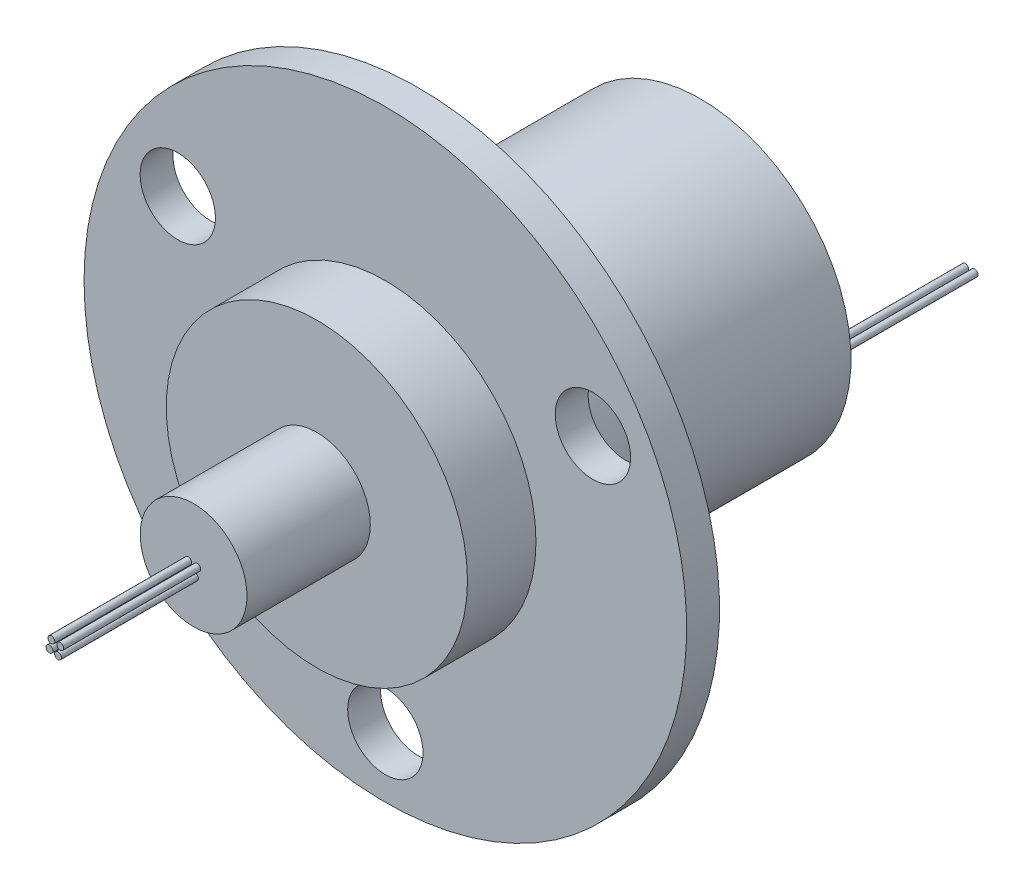
ISO-10303-21;
HEADER;
FILE_DESCRIPTION(('STEP AP214'),'2;1');
FILE_NAME('part.step','',(''),(''),'','','');
FILE_SCHEMA(('AUTOMOTIVE_DESIGN { 1 0 10303 214 1 1 1 1 }'));
ENDSEC;
DATA;
#1=APPLICATION_CONTEXT('core data for automotive mechanical design processes');
#2=APPLICATION_PROTOCOL_DEFINITION('international standard','automotive_design',2000,#1);
#3=PRODUCT_CONTEXT('',#1,'mechanical');
#4=PRODUCT('Part','Part','',(#3));
#5=PRODUCT_RELATED_PRODUCT_CATEGORY('part','',(#4));
#6=PRODUCT_DEFINITION_FORMATION('','',#4);
#7=PRODUCT_DEFINITION_CONTEXT('part definition',#1,'design');
#8=PRODUCT_DEFINITION('design','',#6,#7);
#9=PRODUCT_DEFINITION_SHAPE('','',#8);
#10=(LENGTH_UNIT() NAMED_UNIT(*) SI_UNIT(.MILLI.,.METRE.));
#11=(NAMED_UNIT(*) PLANE_ANGLE_UNIT() SI_UNIT($,.RADIAN.));
#12=(NAMED_UNIT(*) SI_UNIT($,.STERADIAN.) SOLID_ANGLE_UNIT());
#13=UNCERTAINTY_MEASURE_WITH_UNIT(LENGTH_MEASURE(1.E-05),#10,'distance_accuracy_value','');
#14=(GEOMETRIC_REPRESENTATION_CONTEXT(3) GLOBAL_UNCERTAINTY_ASSIGNED_CONTEXT((#13)) GLOBAL_UNIT_ASSIGNED_CONTEXT((#10,
#11,#12)) REPRESENTATION_CONTEXT('',''));
#15=CARTESIAN_POINT('',(0.,0.,0.));
#16=DIRECTION('',(0.,0.,1.));
#17=DIRECTION('',(1.,0.,0.));
#18=AXIS2_PLACEMENT_3D('',#15,#16,#17);
#19=CARTESIAN_POINT('',(0.,0.,0.));
#20=DIRECTION('',(0.,0.,-1.));
#21=DIRECTION('',(-1.,0.,0.));
#22=AXIS2_PLACEMENT_3D('',#19,#20,#21);
#23=PLANE('',#22);
#24=CARTESIAN_POINT('',(15.1554445662278,8.74999999999986,0.));
#25=DIRECTION('',(0.,0.,-1.));
#26=DIRECTION('',(-1.,0.,0.));
#27=AXIS2_PLACEMENT_3D('',#24,#25,#26);
#28=CIRCLE('',#27,2.74999999999998);
#29=CARTESIAN_POINT('',(12.4054445662278,8.74999999999986,0.));
#30=VERTEX_POINT('',#29);
#31=EDGE_CURVE('E63',#30,#30,#28,.T.);
#32=ORIENTED_EDGE('',*,*,#31,.F.);
#33=EDGE_LOOP('',(#32));
#34=FACE_BOUND('',#33,.T.);
#35=CARTESIAN_POINT('',(-15.1554445662276,8.75000000000007,0.));
#36=DIRECTION('',(0.,0.,-1.));
#37=DIRECTION('',(-1.,0.,0.));
#38=AXIS2_PLACEMENT_3D('',#35,#36,#37);
#39=CIRCLE('',#38,2.74999999999998);
#40=CARTESIAN_POINT('',(-17.9054445662276,8.75000000000007,0.));
#41=VERTEX_POINT('',#40);
#42=EDGE_CURVE('E53',#41,#41,#39,.T.);
#43=ORIENTED_EDGE('',*,*,#42,.F.);
#44=EDGE_LOOP('',(#43));
#45=FACE_BOUND('',#44,.T.);
#46=CARTESIAN_POINT('',(0.,-17.5,0.));
#47=DIRECTION('',(0.,0.,-1.));
#48=DIRECTION('',(-1.,0.,0.));
#49=AXIS2_PLACEMENT_3D('',#46,#47,#48);
#50=CIRCLE('',#49,2.74999999999998);
#51=CARTESIAN_POINT('',(-2.74999999999998,-17.5,0.));
#52=VERTEX_POINT('',#51);
#53=EDGE_CURVE('E50',#52,#52,#50,.T.);
#54=ORIENTED_EDGE('',*,*,#53,.F.);
#55=EDGE_LOOP('',(#54));
#56=FACE_BOUND('',#55,.T.);
#57=CARTESIAN_POINT('',(0.,0.,0.));
#58=DIRECTION('',(0.,0.,-1.));
#59=DIRECTION('',(-1.,0.,0.));
#60=AXIS2_PLACEMENT_3D('',#57,#58,#59);
#61=CIRCLE('',#60,22.);
#62=CARTESIAN_POINT('',(-22.,0.,0.));
#63=VERTEX_POINT('',#62);
#64=EDGE_CURVE('E105',#63,#63,#61,.T.);
#65=ORIENTED_EDGE('',*,*,#64,.T.);
#66=EDGE_LOOP('',(#65));
#67=FACE_BOUND('',#66,.T.);
#68=CARTESIAN_POINT('',(0.,0.,0.));
#69=DIRECTION('',(0.,0.,-1.));
#70=DIRECTION('',(-1.,0.,0.));
#71=AXIS2_PLACEMENT_3D('',#68,#69,#70);
#72=CIRCLE('',#71,11.);
#73=CARTESIAN_POINT('',(-11.,0.,0.));
#74=VERTEX_POINT('',#73);
#75=EDGE_CURVE('E89',#74,#74,#72,.T.);
#76=ORIENTED_EDGE('',*,*,#75,.F.);
#77=EDGE_LOOP('',(#76));
#78=FACE_BOUND('',#77,.T.);
#79=ADVANCED_FACE('F30',(#34,#45,#56,#67,#78),#23,.T.);
#80=CARTESIAN_POINT('',(0.,0.,7.4));
#81=DIRECTION('',(0.,0.,1.));
#82=DIRECTION('',(1.,0.,0.));
#83=AXIS2_PLACEMENT_3D('',#80,#81,#82);
#84=PLANE('',#83);
#85=CARTESIAN_POINT('',(0.,0.,7.4));
#86=DIRECTION('',(0.,0.,1.));
#87=DIRECTION('',(1.,0.,0.));
#88=AXIS2_PLACEMENT_3D('',#85,#86,#87);
#89=CIRCLE('',#88,11.);
#90=CARTESIAN_POINT('',(11.,0.,7.4));
#91=VERTEX_POINT('',#90);
#92=EDGE_CURVE('E102',#91,#91,#89,.T.);
#93=ORIENTED_EDGE('',*,*,#92,.T.);
#94=EDGE_LOOP('',(#93));
#95=FACE_BOUND('',#94,.T.);
#96=CARTESIAN_POINT('',(0.,0.,7.4));
#97=DIRECTION('',(0.,0.,1.));
#98=DIRECTION('',(1.,0.,0.));
#99=AXIS2_PLACEMENT_3D('',#96,#97,#98);
#100=CIRCLE('',#99,3.9);
#101=CARTESIAN_POINT('',(3.9,0.,7.4));
#102=VERTEX_POINT('',#101);
#103=EDGE_CURVE('E93',#102,#102,#100,.T.);
#104=ORIENTED_EDGE('',*,*,#103,.F.);
#105=EDGE_LOOP('',(#104));
#106=FACE_BOUND('',#105,.T.);
#107=ADVANCED_FACE('F152',(#95,#106),#84,.T.);
#108=CARTESIAN_POINT('',(22.,0.,2.4));
#109=DIRECTION('',(0.,0.,1.));
#110=DIRECTION('',(1.,0.,0.));
#111=AXIS2_PLACEMENT_3D('',#108,#109,#110);
#112=PLANE('',#111);
#113=CARTESIAN_POINT('',(15.1554445662278,8.74999999999986,2.4));
#114=DIRECTION('',(0.,0.,1.));
#115=DIRECTION('',(1.,0.,0.));
#116=AXIS2_PLACEMENT_3D('',#113,#114,#115);
#117=CIRCLE('',#116,2.74999999999998);
#118=CARTESIAN_POINT('',(17.9054445662277,8.74999999999986,2.4));
#119=VERTEX_POINT('',#118);
#120=EDGE_CURVE('E34',#119,#119,#117,.T.);
#121=ORIENTED_EDGE('',*,*,#120,.F.);
#122=EDGE_LOOP('',(#121));
#123=FACE_BOUND('',#122,.T.);
#124=CARTESIAN_POINT('',(-15.1554445662276,8.75000000000007,2.4));
#125=DIRECTION('',(0.,0.,1.));
#126=DIRECTION('',(1.,0.,0.));
#127=AXIS2_PLACEMENT_3D('',#124,#125,#126);
#128=CIRCLE('',#127,2.74999999999998);
#129=CARTESIAN_POINT('',(-12.4054445662277,8.75000000000007,2.4));
#130=VERTEX_POINT('',#129);
#131=EDGE_CURVE('E51',#130,#130,#128,.T.);
#132=ORIENTED_EDGE('',*,*,#131,.F.);
#133=EDGE_LOOP('',(#132));
#134=FACE_BOUND('',#133,.T.);
#135=CARTESIAN_POINT('',(0.,-17.5,2.4));
#136=DIRECTION('',(0.,0.,1.));
#137=DIRECTION('',(1.,0.,0.));
#138=AXIS2_PLACEMENT_3D('',#135,#136,#137);
#139=CIRCLE('',#138,2.74999999999998);
#140=CARTESIAN_POINT('',(2.74999999999998,-17.5,2.4));
#141=VERTEX_POINT('',#140);
#142=EDGE_CURVE('E47',#141,#141,#139,.T.);
#143=ORIENTED_EDGE('',*,*,#142,.F.);
#144=EDGE_LOOP('',(#143));
#145=FACE_BOUND('',#144,.T.);
#146=CARTESIAN_POINT('',(0.,0.,2.4));
#147=DIRECTION('',(0.,0.,-1.));
#148=DIRECTION('',(-1.,0.,0.));
#149=AXIS2_PLACEMENT_3D('',#146,#147,#148);
#150=CIRCLE('',#149,22.);
#151=CARTESIAN_POINT('',(-22.,0.,2.4));
#152=VERTEX_POINT('',#151);
#153=EDGE_CURVE('E110',#152,#152,#150,.T.);
#154=ORIENTED_EDGE('',*,*,#153,.F.);
#155=EDGE_LOOP('',(#154));
#156=FACE_BOUND('',#155,.T.);
#157=CARTESIAN_POINT('',(0.,0.,2.4));
#158=DIRECTION('',(0.,0.,1.));
#159=DIRECTION('',(1.,0.,0.));
#160=AXIS2_PLACEMENT_3D('',#157,#158,#159);
#161=CIRCLE('',#160,11.);
#162=CARTESIAN_POINT('',(11.,0.,2.4));
#163=VERTEX_POINT('',#162);
#164=EDGE_CURVE('E99',#163,#163,#161,.T.);
#165=ORIENTED_EDGE('',*,*,#164,.F.);
#166=EDGE_LOOP('',(#165));
#167=FACE_BOUND('',#166,.T.);
#168=ADVANCED_FACE('F158',(#123,#134,#145,#156,#167),#112,.T.);
#169=CARTESIAN_POINT('',(0.,0.,2.4));
#170=DIRECTION('',(0.,0.,-1.));
#171=DIRECTION('',(-1.,0.,0.));
#172=AXIS2_PLACEMENT_3D('',#169,#170,#171);
#173=CYLINDRICAL_SURFACE('',#172,22.);
#174=ORIENTED_EDGE('',*,*,#153,.T.);
#175=EDGE_LOOP('',(#174));
#176=FACE_BOUND('',#175,.T.);
#177=ORIENTED_EDGE('',*,*,#64,.F.);
#178=EDGE_LOOP('',(#177));
#179=FACE_BOUND('',#178,.T.);
#180=ADVANCED_FACE('F32',(#176,#179),#173,.T.);
#181=CARTESIAN_POINT('',(0.,0.,7.4));
#182=DIRECTION('',(0.,0.,-1.));
#183=DIRECTION('',(-1.,0.,0.));
#184=AXIS2_PLACEMENT_3D('',#181,#182,#183);
#185=CYLINDRICAL_SURFACE('',#184,11.);
#186=ORIENTED_EDGE('',*,*,#92,.F.);
#187=EDGE_LOOP('',(#186));
#188=FACE_BOUND('',#187,.T.);
#189=ORIENTED_EDGE('',*,*,#164,.T.);
#190=EDGE_LOOP('',(#189));
#191=FACE_BOUND('',#190,.T.);
#192=ADVANCED_FACE('F164',(#188,#191),#185,.T.);
#193=CARTESIAN_POINT('',(0.,0.,16.4));
#194=DIRECTION('',(0.,0.,-1.));
#195=DIRECTION('',(-1.,0.,0.));
#196=AXIS2_PLACEMENT_3D('',#193,#194,#195);
#197=CYLINDRICAL_SURFACE('',#196,3.9);
#198=CARTESIAN_POINT('',(0.,0.,16.4));
#199=DIRECTION('',(0.,0.,1.));
#200=DIRECTION('',(1.,0.,0.));
#201=AXIS2_PLACEMENT_3D('',#198,#199,#200);
#202=CIRCLE('',#201,3.9);
#203=CARTESIAN_POINT('',(3.9,0.,16.4));
#204=VERTEX_POINT('',#203);
#205=EDGE_CURVE('E96',#204,#204,#202,.T.);
#206=ORIENTED_EDGE('',*,*,#205,.F.);
#207=EDGE_LOOP('',(#206));
#208=FACE_BOUND('',#207,.T.);
#209=ORIENTED_EDGE('',*,*,#103,.T.);
#210=EDGE_LOOP('',(#209));
#211=FACE_BOUND('',#210,.T.);
#212=ADVANCED_FACE('F181',(#208,#211),#197,.T.);
#213=CARTESIAN_POINT('',(0.,0.,16.4));
#214=DIRECTION('',(0.,0.,1.));
#215=DIRECTION('',(1.,0.,0.));
#216=AXIS2_PLACEMENT_3D('',#213,#214,#215);
#217=PLANE('',#216);
#218=CARTESIAN_POINT('',(0.263776295341245,0.,16.4));
#219=DIRECTION('',(0.,0.,1.));
#220=DIRECTION('',(1.,0.,0.));
#221=AXIS2_PLACEMENT_3D('',#218,#219,#220);
#222=CIRCLE('',#221,0.25);
#223=CARTESIAN_POINT('',(0.513776295341245,0.,16.4));
#224=VERTEX_POINT('',#223);
#225=EDGE_CURVE('E10',#224,#224,#222,.T.);
#226=ORIENTED_EDGE('',*,*,#225,.F.);
#227=EDGE_LOOP('',(#226));
#228=FACE_BOUND('',#227,.T.);
#229=CARTESIAN_POINT('',(-0.527355811641428,-0.562471216596805,16.4));
#230=DIRECTION('',(0.,0.,1.));
#231=DIRECTION('',(1.,0.,0.));
#232=AXIS2_PLACEMENT_3D('',#229,#230,#231);
#233=CIRCLE('',#232,0.25);
#234=CARTESIAN_POINT('',(-0.277355811641428,-0.562471216596805,16.4));
#235=VERTEX_POINT('',#234);
#236=EDGE_CURVE('E119',#235,#235,#233,.T.);
#237=ORIENTED_EDGE('',*,*,#236,.F.);
#238=EDGE_LOOP('',(#237));
#239=FACE_BOUND('',#238,.T.);
#240=CARTESIAN_POINT('',(-0.38516931155641,0.0911610825937714,16.4));
#241=DIRECTION('',(0.,0.,1.));
#242=DIRECTION('',(1.,0.,0.));
#243=AXIS2_PLACEMENT_3D('',#240,#241,#242);
#244=CIRCLE('',#243,0.25);
#245=CARTESIAN_POINT('',(-0.13516931155641,0.0911610825937714,16.4));
#246=VERTEX_POINT('',#245);
#247=EDGE_CURVE('E116',#246,#246,#244,.T.);
#248=ORIENTED_EDGE('',*,*,#247,.F.);
#249=EDGE_LOOP('',(#248));
#250=FACE_BOUND('',#249,.T.);
#251=CARTESIAN_POINT('',(0.0981194299924937,-0.675788748253581,16.4));
#252=DIRECTION('',(0.,0.,1.));
#253=DIRECTION('',(1.,0.,0.));
#254=AXIS2_PLACEMENT_3D('',#251,#252,#253);
#255=CIRCLE('',#254,0.25);
#256=CARTESIAN_POINT('',(0.348119429992494,-0.675788748253581,16.4));
#257=VERTEX_POINT('',#256);
#258=EDGE_CURVE('E113',#257,#257,#255,.T.);
#259=ORIENTED_EDGE('',*,*,#258,.F.);
#260=EDGE_LOOP('',(#259));
#261=FACE_BOUND('',#260,.T.);
#262=ORIENTED_EDGE('',*,*,#205,.T.);
#263=EDGE_LOOP('',(#262));
#264=FACE_BOUND('',#263,.T.);
#265=ADVANCED_FACE('F147',(#228,#239,#250,#261,#264),#217,.T.);
#266=CARTESIAN_POINT('',(0.,0.,-20.6));
#267=DIRECTION('',(0.,0.,1.));
#268=DIRECTION('',(1.,0.,0.));
#269=AXIS2_PLACEMENT_3D('',#266,#267,#268);
#270=CYLINDRICAL_SURFACE('',#269,11.);
#271=CARTESIAN_POINT('',(0.,0.,-20.6));
#272=DIRECTION('',(0.,0.,-1.));
#273=DIRECTION('',(-1.,0.,0.));
#274=AXIS2_PLACEMENT_3D('',#271,#272,#273);
#275=CIRCLE('',#274,11.);
#276=CARTESIAN_POINT('',(-11.,0.,-20.6));
#277=VERTEX_POINT('',#276);
#278=EDGE_CURVE('E90',#277,#277,#275,.T.);
#279=ORIENTED_EDGE('',*,*,#278,.F.);
#280=EDGE_LOOP('',(#279));
#281=FACE_BOUND('',#280,.T.);
#282=ORIENTED_EDGE('',*,*,#75,.T.);
#283=EDGE_LOOP('',(#282));
#284=FACE_BOUND('',#283,.T.);
#285=ADVANCED_FACE('F136',(#281,#284),#270,.T.);
#286=CARTESIAN_POINT('',(0.,0.,-20.6));
#287=DIRECTION('',(0.,0.,-1.));
#288=DIRECTION('',(-1.,0.,0.));
#289=AXIS2_PLACEMENT_3D('',#286,#287,#288);
#290=PLANE('',#289);
#291=CARTESIAN_POINT('',(-10.102336314438,0.,-20.6));
#292=DIRECTION('',(0.,0.,-1.));
#293=DIRECTION('',(-1.,0.,0.));
#294=AXIS2_PLACEMENT_3D('',#291,#292,#293);
#295=CIRCLE('',#294,0.25);
#296=CARTESIAN_POINT('',(-10.352336314438,0.,-20.6));
#297=VERTEX_POINT('',#296);
#298=EDGE_CURVE('E38',#297,#297,#295,.T.);
#299=ORIENTED_EDGE('',*,*,#298,.F.);
#300=EDGE_LOOP('',(#299));
#301=FACE_BOUND('',#300,.T.);
#302=CARTESIAN_POINT('',(9.34429353671362,0.,-20.6));
#303=DIRECTION('',(0.,0.,-1.));
#304=DIRECTION('',(-1.,0.,0.));
#305=AXIS2_PLACEMENT_3D('',#302,#303,#304);
#306=CIRCLE('',#305,0.25);
#307=CARTESIAN_POINT('',(9.09429353671362,0.,-20.6));
#308=VERTEX_POINT('',#307);
#309=EDGE_CURVE('E43',#308,#308,#306,.T.);
#310=ORIENTED_EDGE('',*,*,#309,.F.);
#311=EDGE_LOOP('',(#310));
#312=FACE_BOUND('',#311,.T.);
#313=CARTESIAN_POINT('',(10.0241698032389,0.,-20.6));
#314=DIRECTION('',(0.,0.,-1.));
#315=DIRECTION('',(-1.,0.,0.));
#316=AXIS2_PLACEMENT_3D('',#313,#314,#315);
#317=CIRCLE('',#316,0.25);
#318=CARTESIAN_POINT('',(9.77416980323892,0.,-20.6));
#319=VERTEX_POINT('',#318);
#320=EDGE_CURVE('E125',#319,#319,#317,.T.);
#321=ORIENTED_EDGE('',*,*,#320,.F.);
#322=EDGE_LOOP('',(#321));
#323=FACE_BOUND('',#322,.T.);
#324=CARTESIAN_POINT('',(-9.26391296849852,0.,-20.6));
#325=DIRECTION('',(0.,0.,-1.));
#326=DIRECTION('',(-1.,0.,0.));
#327=AXIS2_PLACEMENT_3D('',#324,#325,#326);
#328=CIRCLE('',#327,0.25);
#329=CARTESIAN_POINT('',(-9.51391296849852,0.,-20.6));
#330=VERTEX_POINT('',#329);
#331=EDGE_CURVE('E122',#330,#330,#328,.T.);
#332=ORIENTED_EDGE('',*,*,#331,.F.);
#333=EDGE_LOOP('',(#332));
#334=FACE_BOUND('',#333,.T.);
#335=ORIENTED_EDGE('',*,*,#278,.T.);
#336=EDGE_LOOP('',(#335));
#337=FACE_BOUND('',#336,.T.);
#338=ADVANCED_FACE('F132',(#301,#312,#323,#334,#337),#290,.T.);
#339=CARTESIAN_POINT('',(0.0981194299924937,-0.675788748253581,26.4));
#340=DIRECTION('',(0.,0.,-1.));
#341=DIRECTION('',(-1.,0.,0.));
#342=AXIS2_PLACEMENT_3D('',#339,#340,#341);
#343=CYLINDRICAL_SURFACE('',#342,0.25);
#344=CARTESIAN_POINT('',(0.0981194299924937,-0.675788748253581,26.4));
#345=DIRECTION('',(0.,0.,-1.));
#346=DIRECTION('',(-1.,0.,0.));
#347=AXIS2_PLACEMENT_3D('',#344,#345,#346);
#348=CIRCLE('',#347,0.25);
#349=CARTESIAN_POINT('',(-0.151880570007506,-0.675788748253581,26.4));
#350=VERTEX_POINT('',#349);
#351=EDGE_CURVE('E86',#350,#350,#348,.T.);
#352=ORIENTED_EDGE('',*,*,#351,.T.);
#353=EDGE_LOOP('',(#352));
#354=FACE_BOUND('',#353,.T.);
#355=ORIENTED_EDGE('',*,*,#258,.T.);
#356=EDGE_LOOP('',(#355));
#357=FACE_BOUND('',#356,.T.);
#358=ADVANCED_FACE('F135',(#354,#357),#343,.T.);
#359=CARTESIAN_POINT('',(0.348119429992494,-0.675788748253581,26.4));
#360=DIRECTION('',(0.,0.,1.));
#361=DIRECTION('',(1.,0.,0.));
#362=AXIS2_PLACEMENT_3D('',#359,#360,#361);
#363=PLANE('',#362);
#364=ORIENTED_EDGE('',*,*,#351,.F.);
#365=EDGE_LOOP('',(#364));
#366=FACE_BOUND('',#365,.T.);
#367=ADVANCED_FACE('F201',(#366),#363,.T.);
#368=CARTESIAN_POINT('',(-0.38516931155641,0.0911610825937714,26.4));
#369=DIRECTION('',(0.,0.,-1.));
#370=DIRECTION('',(-1.,0.,0.));
#371=AXIS2_PLACEMENT_3D('',#368,#369,#370);
#372=CYLINDRICAL_SURFACE('',#371,0.25);
#373=CARTESIAN_POINT('',(-0.38516931155641,0.0911610825937714,26.4));
#374=DIRECTION('',(0.,0.,-1.));
#375=DIRECTION('',(-1.,0.,0.));
#376=AXIS2_PLACEMENT_3D('',#373,#374,#375);
#377=CIRCLE('',#376,0.25);
#378=CARTESIAN_POINT('',(-0.63516931155641,0.0911610825937714,26.4));
#379=VERTEX_POINT('',#378);
#380=EDGE_CURVE('E83',#379,#379,#377,.T.);
#381=ORIENTED_EDGE('',*,*,#380,.T.);
#382=EDGE_LOOP('',(#381));
#383=FACE_BOUND('',#382,.T.);
#384=ORIENTED_EDGE('',*,*,#247,.T.);
#385=EDGE_LOOP('',(#384));
#386=FACE_BOUND('',#385,.T.);
#387=ADVANCED_FACE('F205',(#383,#386),#372,.T.);
#388=CARTESIAN_POINT('',(-0.13516931155641,0.0911610825937714,26.4));
#389=DIRECTION('',(0.,0.,1.));
#390=DIRECTION('',(1.,0.,0.));
#391=AXIS2_PLACEMENT_3D('',#388,#389,#390);
#392=PLANE('',#391);
#393=ORIENTED_EDGE('',*,*,#380,.F.);
#394=EDGE_LOOP('',(#393));
#395=FACE_BOUND('',#394,.T.);
#396=ADVANCED_FACE('F209',(#395),#392,.T.);
#397=CARTESIAN_POINT('',(-0.527355811641428,-0.562471216596805,26.4));
#398=DIRECTION('',(0.,0.,-1.));
#399=DIRECTION('',(-1.,0.,0.));
#400=AXIS2_PLACEMENT_3D('',#397,#398,#399);
#401=CYLINDRICAL_SURFACE('',#400,0.25);
#402=CARTESIAN_POINT('',(-0.527355811641428,-0.562471216596805,26.4));
#403=DIRECTION('',(0.,0.,-1.));
#404=DIRECTION('',(-1.,0.,0.));
#405=AXIS2_PLACEMENT_3D('',#402,#403,#404);
#406=CIRCLE('',#405,0.25);
#407=CARTESIAN_POINT('',(-0.777355811641428,-0.562471216596805,26.4));
#408=VERTEX_POINT('',#407);
#409=EDGE_CURVE('E80',#408,#408,#406,.T.);
#410=ORIENTED_EDGE('',*,*,#409,.T.);
#411=EDGE_LOOP('',(#410));
#412=FACE_BOUND('',#411,.T.);
#413=ORIENTED_EDGE('',*,*,#236,.T.);
#414=EDGE_LOOP('',(#413));
#415=FACE_BOUND('',#414,.T.);
#416=ADVANCED_FACE('F213',(#412,#415),#401,.T.);
#417=CARTESIAN_POINT('',(-0.277355811641428,-0.562471216596805,26.4));
#418=DIRECTION('',(0.,0.,1.));
#419=DIRECTION('',(1.,0.,0.));
#420=AXIS2_PLACEMENT_3D('',#417,#418,#419);
#421=PLANE('',#420);
#422=ORIENTED_EDGE('',*,*,#409,.F.);
#423=EDGE_LOOP('',(#422));
#424=FACE_BOUND('',#423,.T.);
#425=ADVANCED_FACE('F217',(#424),#421,.T.);
#426=CARTESIAN_POINT('',(-9.26391296849852,0.,-30.6));
#427=DIRECTION('',(0.,0.,1.));
#428=DIRECTION('',(1.,0.,0.));
#429=AXIS2_PLACEMENT_3D('',#426,#427,#428);
#430=CYLINDRICAL_SURFACE('',#429,0.25);
#431=CARTESIAN_POINT('',(-9.26391296849852,0.,-30.6));
#432=DIRECTION('',(0.,0.,1.));
#433=DIRECTION('',(1.,0.,0.));
#434=AXIS2_PLACEMENT_3D('',#431,#432,#433);
#435=CIRCLE('',#434,0.25);
#436=CARTESIAN_POINT('',(-9.01391296849852,0.,-30.6));
#437=VERTEX_POINT('',#436);
#438=EDGE_CURVE('E77',#437,#437,#435,.T.);
#439=ORIENTED_EDGE('',*,*,#438,.T.);
#440=EDGE_LOOP('',(#439));
#441=FACE_BOUND('',#440,.T.);
#442=ORIENTED_EDGE('',*,*,#331,.T.);
#443=EDGE_LOOP('',(#442));
#444=FACE_BOUND('',#443,.T.);
#445=ADVANCED_FACE('F221',(#441,#444),#430,.T.);
#446=CARTESIAN_POINT('',(-9.01391296849852,0.,-30.6));
#447=DIRECTION('',(0.,0.,-1.));
#448=DIRECTION('',(-1.,0.,0.));
#449=AXIS2_PLACEMENT_3D('',#446,#447,#448);
#450=PLANE('',#449);
#451=ORIENTED_EDGE('',*,*,#438,.F.);
#452=EDGE_LOOP('',(#451));
#453=FACE_BOUND('',#452,.T.);
#454=ADVANCED_FACE('F225',(#453),#450,.T.);
#455=CARTESIAN_POINT('',(10.0241698032389,0.,-30.6));
#456=DIRECTION('',(0.,0.,1.));
#457=DIRECTION('',(1.,0.,0.));
#458=AXIS2_PLACEMENT_3D('',#455,#456,#457);
#459=CYLINDRICAL_SURFACE('',#458,0.25);
#460=CARTESIAN_POINT('',(10.0241698032389,0.,-30.6));
#461=DIRECTION('',(0.,0.,1.));
#462=DIRECTION('',(1.,0.,0.));
#463=AXIS2_PLACEMENT_3D('',#460,#461,#462);
#464=CIRCLE('',#463,0.25);
#465=CARTESIAN_POINT('',(10.2741698032389,0.,-30.6));
#466=VERTEX_POINT('',#465);
#467=EDGE_CURVE('E74',#466,#466,#464,.T.);
#468=ORIENTED_EDGE('',*,*,#467,.T.);
#469=EDGE_LOOP('',(#468));
#470=FACE_BOUND('',#469,.T.);
#471=ORIENTED_EDGE('',*,*,#320,.T.);
#472=EDGE_LOOP('',(#471));
#473=FACE_BOUND('',#472,.T.);
#474=ADVANCED_FACE('F229',(#470,#473),#459,.T.);
#475=CARTESIAN_POINT('',(10.2741698032389,0.,-30.6));
#476=DIRECTION('',(0.,0.,-1.));
#477=DIRECTION('',(-1.,0.,0.));
#478=AXIS2_PLACEMENT_3D('',#475,#476,#477);
#479=PLANE('',#478);
#480=ORIENTED_EDGE('',*,*,#467,.F.);
#481=EDGE_LOOP('',(#480));
#482=FACE_BOUND('',#481,.T.);
#483=ADVANCED_FACE('F233',(#482),#479,.T.);
#484=CARTESIAN_POINT('',(9.34429353671362,0.,-30.6));
#485=DIRECTION('',(0.,0.,1.));
#486=DIRECTION('',(1.,0.,0.));
#487=AXIS2_PLACEMENT_3D('',#484,#485,#486);
#488=CYLINDRICAL_SURFACE('',#487,0.25);
#489=CARTESIAN_POINT('',(9.34429353671362,0.,-30.6));
#490=DIRECTION('',(0.,0.,1.));
#491=DIRECTION('',(1.,0.,0.));
#492=AXIS2_PLACEMENT_3D('',#489,#490,#491);
#493=CIRCLE('',#492,0.25);
#494=CARTESIAN_POINT('',(9.59429353671362,0.,-30.6));
#495=VERTEX_POINT('',#494);
#496=EDGE_CURVE('E71',#495,#495,#493,.T.);
#497=ORIENTED_EDGE('',*,*,#496,.T.);
#498=EDGE_LOOP('',(#497));
#499=FACE_BOUND('',#498,.T.);
#500=ORIENTED_EDGE('',*,*,#309,.T.);
#501=EDGE_LOOP('',(#500));
#502=FACE_BOUND('',#501,.T.);
#503=ADVANCED_FACE('F130',(#499,#502),#488,.T.);
#504=CARTESIAN_POINT('',(9.59429353671362,0.,-30.6));
#505=DIRECTION('',(0.,0.,-1.));
#506=DIRECTION('',(-1.,0.,0.));
#507=AXIS2_PLACEMENT_3D('',#504,#505,#506);
#508=PLANE('',#507);
#509=ORIENTED_EDGE('',*,*,#496,.F.);
#510=EDGE_LOOP('',(#509));
#511=FACE_BOUND('',#510,.T.);
#512=ADVANCED_FACE('F240',(#511),#508,.T.);
#513=CARTESIAN_POINT('',(-10.102336314438,0.,-30.6));
#514=DIRECTION('',(0.,0.,1.));
#515=DIRECTION('',(1.,0.,0.));
#516=AXIS2_PLACEMENT_3D('',#513,#514,#515);
#517=CYLINDRICAL_SURFACE('',#516,0.25);
#518=CARTESIAN_POINT('',(-10.102336314438,0.,-30.6));
#519=DIRECTION('',(0.,0.,1.));
#520=DIRECTION('',(1.,0.,0.));
#521=AXIS2_PLACEMENT_3D('',#518,#519,#520);
#522=CIRCLE('',#521,0.25);
#523=CARTESIAN_POINT('',(-9.85233631443805,0.,-30.6));
#524=VERTEX_POINT('',#523);
#525=EDGE_CURVE('E68',#524,#524,#522,.T.);
#526=ORIENTED_EDGE('',*,*,#525,.T.);
#527=EDGE_LOOP('',(#526));
#528=FACE_BOUND('',#527,.T.);
#529=ORIENTED_EDGE('',*,*,#298,.T.);
#530=EDGE_LOOP('',(#529));
#531=FACE_BOUND('',#530,.T.);
#532=ADVANCED_FACE('F244',(#528,#531),#517,.T.);
#533=CARTESIAN_POINT('',(-9.85233631443805,0.,-30.6));
#534=DIRECTION('',(0.,0.,-1.));
#535=DIRECTION('',(-1.,0.,0.));
#536=AXIS2_PLACEMENT_3D('',#533,#534,#535);
#537=PLANE('',#536);
#538=ORIENTED_EDGE('',*,*,#525,.F.);
#539=EDGE_LOOP('',(#538));
#540=FACE_BOUND('',#539,.T.);
#541=ADVANCED_FACE('F248',(#540),#537,.T.);
#542=CARTESIAN_POINT('',(0.263776295341245,0.,26.4));
#543=DIRECTION('',(0.,0.,-1.));
#544=DIRECTION('',(-1.,0.,0.));
#545=AXIS2_PLACEMENT_3D('',#542,#543,#544);
#546=CYLINDRICAL_SURFACE('',#545,0.25);
#547=CARTESIAN_POINT('',(0.263776295341245,0.,26.4));
#548=DIRECTION('',(0.,0.,-1.));
#549=DIRECTION('',(-1.,0.,0.));
#550=AXIS2_PLACEMENT_3D('',#547,#548,#549);
#551=CIRCLE('',#550,0.25);
#552=CARTESIAN_POINT('',(0.0137762953412448,0.,26.4));
#553=VERTEX_POINT('',#552);
#554=EDGE_CURVE('E49',#553,#553,#551,.T.);
#555=ORIENTED_EDGE('',*,*,#554,.T.);
#556=EDGE_LOOP('',(#555));
#557=FACE_BOUND('',#556,.T.);
#558=ORIENTED_EDGE('',*,*,#225,.T.);
#559=EDGE_LOOP('',(#558));
#560=FACE_BOUND('',#559,.T.);
#561=ADVANCED_FACE('F252',(#557,#560),#546,.T.);
#562=CARTESIAN_POINT('',(0.513776295341245,0.,26.4));
#563=DIRECTION('',(0.,0.,1.));
#564=DIRECTION('',(1.,0.,0.));
#565=AXIS2_PLACEMENT_3D('',#562,#563,#564);
#566=PLANE('',#565);
#567=ORIENTED_EDGE('',*,*,#554,.F.);
#568=EDGE_LOOP('',(#567));
#569=FACE_BOUND('',#568,.T.);
#570=ADVANCED_FACE('F256',(#569),#566,.T.);
#571=CARTESIAN_POINT('',(0.,-17.5,0.));
#572=DIRECTION('',(0.,0.,-1.));
#573=DIRECTION('',(-1.,0.,0.));
#574=AXIS2_PLACEMENT_3D('',#571,#572,#573);
#575=CYLINDRICAL_SURFACE('',#574,2.74999999999998);
#576=ORIENTED_EDGE('',*,*,#142,.T.);
#577=EDGE_LOOP('',(#576));
#578=FACE_BOUND('',#577,.T.);
#579=ORIENTED_EDGE('',*,*,#53,.T.);
#580=EDGE_LOOP('',(#579));
#581=FACE_BOUND('',#580,.T.);
#582=ADVANCED_FACE('F260',(#578,#581),#575,.F.);
#583=CARTESIAN_POINT('',(-15.1554445662276,8.75000000000007,0.));
#584=DIRECTION('',(0.,0.,-1.));
#585=DIRECTION('',(-1.,0.,0.));
#586=AXIS2_PLACEMENT_3D('',#583,#584,#585);
#587=CYLINDRICAL_SURFACE('',#586,2.74999999999998);
#588=ORIENTED_EDGE('',*,*,#131,.T.);
#589=EDGE_LOOP('',(#588));
#590=FACE_BOUND('',#589,.T.);
#591=ORIENTED_EDGE('',*,*,#42,.T.);
#592=EDGE_LOOP('',(#591));
#593=FACE_BOUND('',#592,.T.);
#594=ADVANCED_FACE('F264',(#590,#593),#587,.F.);
#595=CARTESIAN_POINT('',(15.1554445662278,8.74999999999986,0.));
#596=DIRECTION('',(0.,0.,-1.));
#597=DIRECTION('',(-1.,0.,0.));
#598=AXIS2_PLACEMENT_3D('',#595,#596,#597);
#599=CYLINDRICAL_SURFACE('',#598,2.74999999999998);
#600=ORIENTED_EDGE('',*,*,#120,.T.);
#601=EDGE_LOOP('',(#600));
#602=FACE_BOUND('',#601,.T.);
#603=ORIENTED_EDGE('',*,*,#31,.T.);
#604=EDGE_LOOP('',(#603));
#605=FACE_BOUND('',#604,.T.);
#606=ADVANCED_FACE('F268',(#602,#605),#599,.F.);
#607=CLOSED_SHELL('',(#79,#107,#168,#180,#192,#212,#265,#285,#338,#358,#367,#387,#396,#416,#425,
#445,#454,#474,#483,#503,#512,#532,#541,#561,#570,#582,#594,#606));
#608=MANIFOLD_SOLID_BREP('B2',#607);
#609=ADVANCED_BREP_SHAPE_REPRESENTATION('',(#18,#608),#14);
#610=SHAPE_DEFINITION_REPRESENTATION(#9,#609);
ENDSEC;
END-ISO-10303-21;
